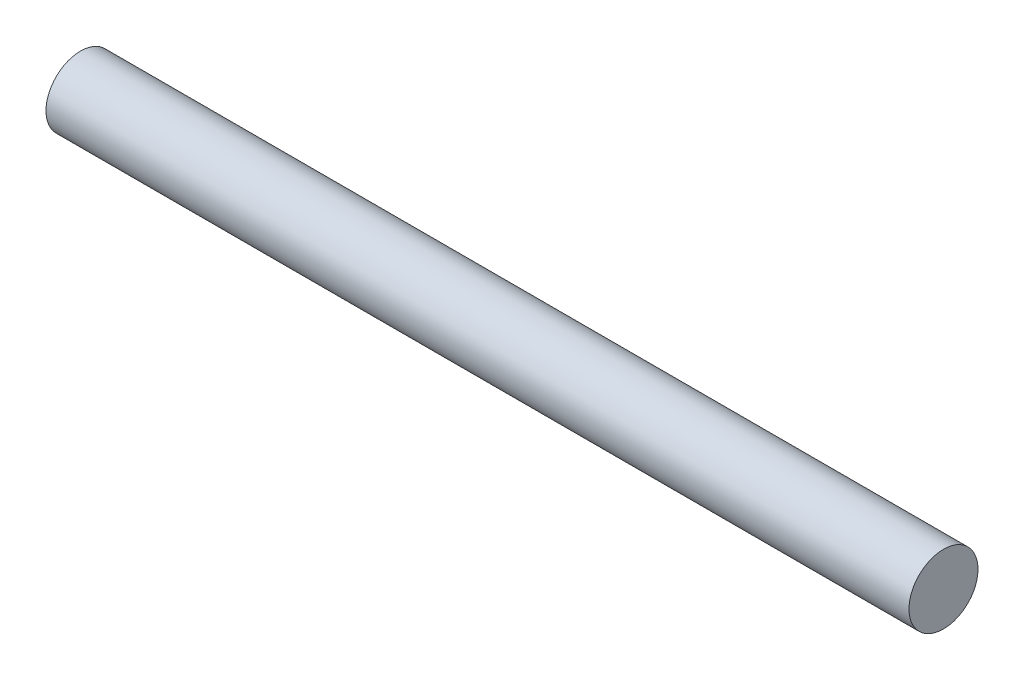
ISO-10303-21;
HEADER;
FILE_DESCRIPTION(('STEP AP214'),'2;1');
FILE_NAME('part.step','',(''),(''),'','','');
FILE_SCHEMA(('AUTOMOTIVE_DESIGN { 1 0 10303 214 1 1 1 1 }'));
ENDSEC;
DATA;
#1=APPLICATION_CONTEXT('core data for automotive mechanical design processes');
#2=APPLICATION_PROTOCOL_DEFINITION('international standard','automotive_design',2000,#1);
#3=PRODUCT_CONTEXT('',#1,'mechanical');
#4=PRODUCT('Part','Part','',(#3));
#5=PRODUCT_RELATED_PRODUCT_CATEGORY('part','',(#4));
#6=PRODUCT_DEFINITION_FORMATION('','',#4);
#7=PRODUCT_DEFINITION_CONTEXT('part definition',#1,'design');
#8=PRODUCT_DEFINITION('design','',#6,#7);
#9=PRODUCT_DEFINITION_SHAPE('','',#8);
#10=(LENGTH_UNIT() NAMED_UNIT(*) SI_UNIT(.MILLI.,.METRE.));
#11=(NAMED_UNIT(*) PLANE_ANGLE_UNIT() SI_UNIT($,.RADIAN.));
#12=(NAMED_UNIT(*) SI_UNIT($,.STERADIAN.) SOLID_ANGLE_UNIT());
#13=UNCERTAINTY_MEASURE_WITH_UNIT(LENGTH_MEASURE(1.E-05),#10,'distance_accuracy_value','');
#14=(GEOMETRIC_REPRESENTATION_CONTEXT(3) GLOBAL_UNCERTAINTY_ASSIGNED_CONTEXT((#13)) GLOBAL_UNIT_ASSIGNED_CONTEXT((#10,
#11,#12)) REPRESENTATION_CONTEXT('',''));
#15=CARTESIAN_POINT('',(0.,0.,0.));
#16=DIRECTION('',(0.,0.,1.));
#17=DIRECTION('',(1.,0.,0.));
#18=AXIS2_PLACEMENT_3D('',#15,#16,#17);
#19=CARTESIAN_POINT('',(50.,4.00000000000002,0.));
#20=DIRECTION('',(1.,0.,0.));
#21=DIRECTION('',(0.,1.,0.));
#22=AXIS2_PLACEMENT_3D('',#19,#20,#21);
#23=PLANE('',#22);
#24=CARTESIAN_POINT('',(50.,0.,0.));
#25=DIRECTION('',(1.,0.,0.));
#26=DIRECTION('',(0.,1.,0.));
#27=AXIS2_PLACEMENT_3D('',#24,#25,#26);
#28=CIRCLE('',#27,4.);
#29=CARTESIAN_POINT('',(50.,4.00000000000002,0.));
#30=VERTEX_POINT('',#29);
#31=EDGE_CURVE('E10',#30,#30,#28,.T.);
#32=ORIENTED_EDGE('',*,*,#31,.T.);
#33=EDGE_LOOP('',(#32));
#34=FACE_BOUND('',#33,.T.);
#35=ADVANCED_FACE('F33',(#34),#23,.T.);
#36=CARTESIAN_POINT('',(50.,0.,0.));
#37=DIRECTION('',(1.,0.,0.));
#38=DIRECTION('',(0.,1.,0.));
#39=AXIS2_PLACEMENT_3D('',#36,#37,#38);
#40=CYLINDRICAL_SURFACE('',#39,4.);
#41=CARTESIAN_POINT('',(-50.,0.,0.));
#42=DIRECTION('',(1.,0.,0.));
#43=DIRECTION('',(0.,1.,0.));
#44=AXIS2_PLACEMENT_3D('',#41,#42,#43);
#45=CIRCLE('',#44,4.);
#46=CARTESIAN_POINT('',(-50.,3.99999999999999,0.));
#47=VERTEX_POINT('',#46);
#48=EDGE_CURVE('E39',#47,#47,#45,.T.);
#49=ORIENTED_EDGE('',*,*,#48,.T.);
#50=EDGE_LOOP('',(#49));
#51=FACE_BOUND('',#50,.T.);
#52=ORIENTED_EDGE('',*,*,#31,.F.);
#53=EDGE_LOOP('',(#52));
#54=FACE_BOUND('',#53,.T.);
#55=ADVANCED_FACE('F45',(#51,#54),#40,.T.);
#56=CARTESIAN_POINT('',(-50.,0.,0.));
#57=DIRECTION('',(-1.,0.,0.));
#58=DIRECTION('',(0.,-1.,0.));
#59=AXIS2_PLACEMENT_3D('',#56,#57,#58);
#60=PLANE('',#59);
#61=ORIENTED_EDGE('',*,*,#48,.F.);
#62=EDGE_LOOP('',(#61));
#63=FACE_BOUND('',#62,.T.);
#64=ADVANCED_FACE('F48',(#63),#60,.T.);
#65=CLOSED_SHELL('',(#35,#55,#64));
#66=MANIFOLD_SOLID_BREP('B2',#65);
#67=ADVANCED_BREP_SHAPE_REPRESENTATION('',(#18,#66),#14);
#68=SHAPE_DEFINITION_REPRESENTATION(#9,#67);
ENDSEC;
END-ISO-10303-21;
